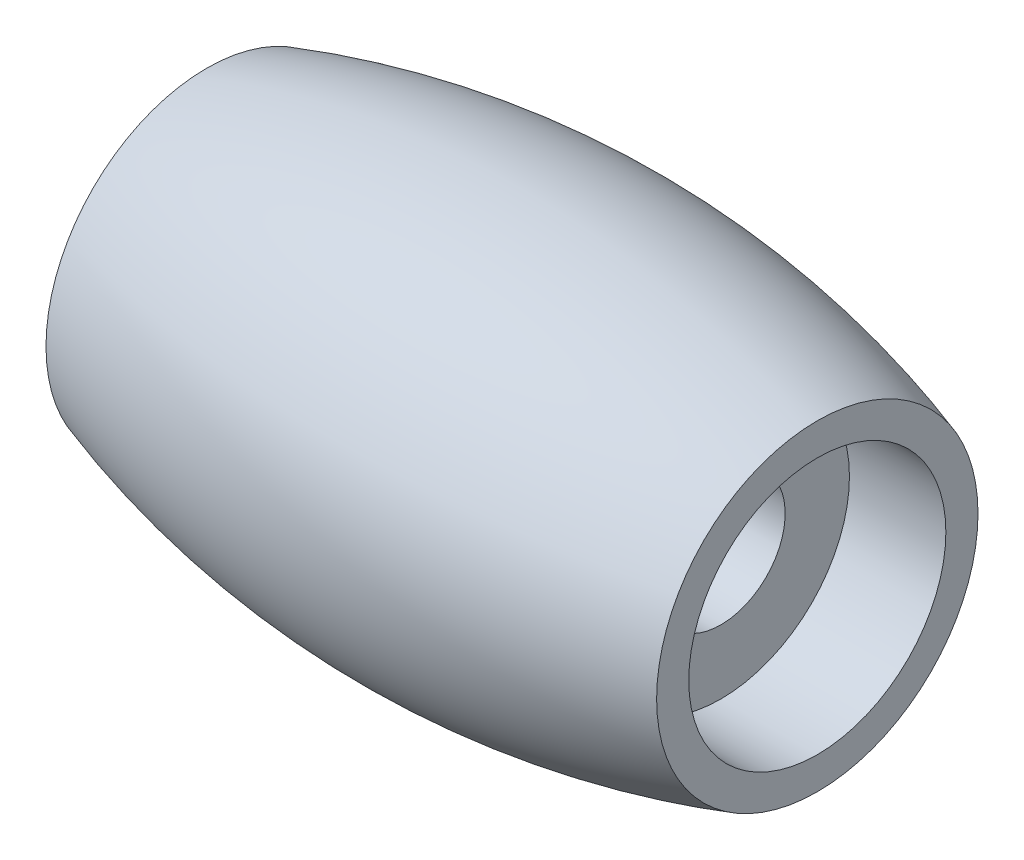
ISO-10303-21;
HEADER;
FILE_DESCRIPTION(('STEP AP214'),'2;1');
FILE_NAME('part.step','',(''),(''),'','','');
FILE_SCHEMA(('AUTOMOTIVE_DESIGN { 1 0 10303 214 1 1 1 1 }'));
ENDSEC;
DATA;
#1=APPLICATION_CONTEXT('core data for automotive mechanical design processes');
#2=APPLICATION_PROTOCOL_DEFINITION('international standard','automotive_design',2000,#1);
#3=PRODUCT_CONTEXT('',#1,'mechanical');
#4=PRODUCT('Part','Part','',(#3));
#5=PRODUCT_RELATED_PRODUCT_CATEGORY('part','',(#4));
#6=PRODUCT_DEFINITION_FORMATION('','',#4);
#7=PRODUCT_DEFINITION_CONTEXT('part definition',#1,'design');
#8=PRODUCT_DEFINITION('design','',#6,#7);
#9=PRODUCT_DEFINITION_SHAPE('','',#8);
#10=(LENGTH_UNIT() NAMED_UNIT(*) SI_UNIT(.MILLI.,.METRE.));
#11=(NAMED_UNIT(*) PLANE_ANGLE_UNIT() SI_UNIT($,.RADIAN.));
#12=(NAMED_UNIT(*) SI_UNIT($,.STERADIAN.) SOLID_ANGLE_UNIT());
#13=UNCERTAINTY_MEASURE_WITH_UNIT(LENGTH_MEASURE(1.E-05),#10,'distance_accuracy_value','');
#14=(GEOMETRIC_REPRESENTATION_CONTEXT(3) GLOBAL_UNCERTAINTY_ASSIGNED_CONTEXT((#13)) GLOBAL_UNIT_ASSIGNED_CONTEXT((#10,
#11,#12)) REPRESENTATION_CONTEXT('',''));
#15=CARTESIAN_POINT('',(0.,0.,0.));
#16=DIRECTION('',(0.,0.,1.));
#17=DIRECTION('',(1.,0.,0.));
#18=AXIS2_PLACEMENT_3D('',#15,#16,#17);
#19=CARTESIAN_POINT('',(0.,0.,0.));
#20=DIRECTION('',(-1.,0.,0.));
#21=DIRECTION('',(0.,0.,1.));
#22=AXIS2_PLACEMENT_3D('',#19,#20,#21);
#23=CYLINDRICAL_SURFACE('',#22,4.);
#24=CARTESIAN_POINT('',(3.,0.,0.));
#25=DIRECTION('',(-1.,0.,0.));
#26=DIRECTION('',(0.,0.,1.));
#27=AXIS2_PLACEMENT_3D('',#24,#25,#26);
#28=CIRCLE('',#27,4.);
#29=CARTESIAN_POINT('',(3.,0.,4.));
#30=VERTEX_POINT('',#29);
#31=EDGE_CURVE('E60',#30,#30,#28,.T.);
#32=ORIENTED_EDGE('',*,*,#31,.F.);
#33=EDGE_LOOP('',(#32));
#34=FACE_BOUND('',#33,.T.);
#35=CARTESIAN_POINT('',(0.,0.,0.));
#36=DIRECTION('',(-1.,0.,0.));
#37=DIRECTION('',(0.,0.,1.));
#38=AXIS2_PLACEMENT_3D('',#35,#36,#37);
#39=CIRCLE('',#38,4.);
#40=CARTESIAN_POINT('',(0.,0.,4.));
#41=VERTEX_POINT('',#40);
#42=EDGE_CURVE('E10',#41,#41,#39,.T.);
#43=ORIENTED_EDGE('',*,*,#42,.T.);
#44=EDGE_LOOP('',(#43));
#45=FACE_BOUND('',#44,.T.);
#46=ADVANCED_FACE('F32',(#34,#45),#23,.F.);
#47=CARTESIAN_POINT('',(0.,4.,0.));
#48=DIRECTION('',(1.,0.,0.));
#49=DIRECTION('',(0.,0.,-1.));
#50=AXIS2_PLACEMENT_3D('',#47,#48,#49);
#51=PLANE('',#50);
#52=ORIENTED_EDGE('',*,*,#42,.F.);
#53=EDGE_LOOP('',(#52));
#54=FACE_BOUND('',#53,.T.);
#55=CARTESIAN_POINT('',(0.,0.,0.));
#56=DIRECTION('',(-1.,0.,0.));
#57=DIRECTION('',(0.,0.,1.));
#58=AXIS2_PLACEMENT_3D('',#55,#56,#57);
#59=CIRCLE('',#58,5.);
#60=CARTESIAN_POINT('',(0.,0.,5.));
#61=VERTEX_POINT('',#60);
#62=EDGE_CURVE('E38',#61,#61,#59,.T.);
#63=ORIENTED_EDGE('',*,*,#62,.T.);
#64=EDGE_LOOP('',(#63));
#65=FACE_BOUND('',#64,.T.);
#66=ADVANCED_FACE('F67',(#54,#65),#51,.F.);
#67=CARTESIAN_POINT('',(9.5,0.,0.));
#68=DIRECTION('',(-1.,0.,0.));
#69=DIRECTION('',(0.,0.,1.));
#70=AXIS2_PLACEMENT_3D('',#67,#68,#69);
#71=DEGENERATE_TOROIDAL_SURFACE('',#70,24.3329829543468,30.833,.F.);
#72=ORIENTED_EDGE('',*,*,#62,.F.);
#73=EDGE_LOOP('',(#72));
#74=FACE_BOUND('',#73,.T.);
#75=CARTESIAN_POINT('',(19.,0.,0.));
#76=DIRECTION('',(-1.,0.,0.));
#77=DIRECTION('',(0.,0.,1.));
#78=AXIS2_PLACEMENT_3D('',#75,#76,#77);
#79=CIRCLE('',#78,5.);
#80=CARTESIAN_POINT('',(19.,0.,5.));
#81=VERTEX_POINT('',#80);
#82=EDGE_CURVE('E42',#81,#81,#79,.T.);
#83=ORIENTED_EDGE('',*,*,#82,.T.);
#84=EDGE_LOOP('',(#83));
#85=FACE_BOUND('',#84,.T.);
#86=ADVANCED_FACE('F71',(#74,#85),#71,.F.);
#87=CARTESIAN_POINT('',(19.,4.,0.));
#88=DIRECTION('',(-1.,0.,0.));
#89=DIRECTION('',(0.,0.,1.));
#90=AXIS2_PLACEMENT_3D('',#87,#88,#89);
#91=PLANE('',#90);
#92=ORIENTED_EDGE('',*,*,#82,.F.);
#93=EDGE_LOOP('',(#92));
#94=FACE_BOUND('',#93,.T.);
#95=CARTESIAN_POINT('',(19.,0.,0.));
#96=DIRECTION('',(-1.,0.,0.));
#97=DIRECTION('',(0.,0.,1.));
#98=AXIS2_PLACEMENT_3D('',#95,#96,#97);
#99=CIRCLE('',#98,4.);
#100=CARTESIAN_POINT('',(19.,0.,4.));
#101=VERTEX_POINT('',#100);
#102=EDGE_CURVE('E46',#101,#101,#99,.T.);
#103=ORIENTED_EDGE('',*,*,#102,.T.);
#104=EDGE_LOOP('',(#103));
#105=FACE_BOUND('',#104,.T.);
#106=ADVANCED_FACE('F76',(#94,#105),#91,.F.);
#107=CARTESIAN_POINT('',(0.,0.,0.));
#108=DIRECTION('',(-1.,0.,0.));
#109=DIRECTION('',(0.,0.,1.));
#110=AXIS2_PLACEMENT_3D('',#107,#108,#109);
#111=CYLINDRICAL_SURFACE('',#110,4.);
#112=ORIENTED_EDGE('',*,*,#102,.F.);
#113=EDGE_LOOP('',(#112));
#114=FACE_BOUND('',#113,.T.);
#115=CARTESIAN_POINT('',(16.,0.,0.));
#116=DIRECTION('',(-1.,0.,0.));
#117=DIRECTION('',(0.,0.,1.));
#118=AXIS2_PLACEMENT_3D('',#115,#116,#117);
#119=CIRCLE('',#118,4.);
#120=CARTESIAN_POINT('',(16.,0.,4.));
#121=VERTEX_POINT('',#120);
#122=EDGE_CURVE('E51',#121,#121,#119,.T.);
#123=ORIENTED_EDGE('',*,*,#122,.T.);
#124=EDGE_LOOP('',(#123));
#125=FACE_BOUND('',#124,.T.);
#126=ADVANCED_FACE('F82',(#114,#125),#111,.F.);
#127=CARTESIAN_POINT('',(16.,2.,0.));
#128=DIRECTION('',(-1.,0.,0.));
#129=DIRECTION('',(0.,0.,1.));
#130=AXIS2_PLACEMENT_3D('',#127,#128,#129);
#131=PLANE('',#130);
#132=ORIENTED_EDGE('',*,*,#122,.F.);
#133=EDGE_LOOP('',(#132));
#134=FACE_BOUND('',#133,.T.);
#135=CARTESIAN_POINT('',(16.,0.,0.));
#136=DIRECTION('',(-1.,0.,0.));
#137=DIRECTION('',(0.,0.,1.));
#138=AXIS2_PLACEMENT_3D('',#135,#136,#137);
#139=CIRCLE('',#138,2.);
#140=CARTESIAN_POINT('',(16.,0.,2.));
#141=VERTEX_POINT('',#140);
#142=EDGE_CURVE('E54',#141,#141,#139,.T.);
#143=ORIENTED_EDGE('',*,*,#142,.T.);
#144=EDGE_LOOP('',(#143));
#145=FACE_BOUND('',#144,.T.);
#146=ADVANCED_FACE('F86',(#134,#145),#131,.F.);
#147=CARTESIAN_POINT('',(0.,0.,0.));
#148=DIRECTION('',(-1.,0.,0.));
#149=DIRECTION('',(0.,0.,1.));
#150=AXIS2_PLACEMENT_3D('',#147,#148,#149);
#151=CYLINDRICAL_SURFACE('',#150,2.);
#152=ORIENTED_EDGE('',*,*,#142,.F.);
#153=EDGE_LOOP('',(#152));
#154=FACE_BOUND('',#153,.T.);
#155=CARTESIAN_POINT('',(3.,0.,0.));
#156=DIRECTION('',(-1.,0.,0.));
#157=DIRECTION('',(0.,0.,1.));
#158=AXIS2_PLACEMENT_3D('',#155,#156,#157);
#159=CIRCLE('',#158,2.);
#160=CARTESIAN_POINT('',(3.,0.,2.));
#161=VERTEX_POINT('',#160);
#162=EDGE_CURVE('E57',#161,#161,#159,.T.);
#163=ORIENTED_EDGE('',*,*,#162,.T.);
#164=EDGE_LOOP('',(#163));
#165=FACE_BOUND('',#164,.T.);
#166=ADVANCED_FACE('F90',(#154,#165),#151,.F.);
#167=CARTESIAN_POINT('',(3.,4.,0.));
#168=DIRECTION('',(1.,0.,0.));
#169=DIRECTION('',(0.,0.,-1.));
#170=AXIS2_PLACEMENT_3D('',#167,#168,#169);
#171=PLANE('',#170);
#172=ORIENTED_EDGE('',*,*,#162,.F.);
#173=EDGE_LOOP('',(#172));
#174=FACE_BOUND('',#173,.T.);
#175=ORIENTED_EDGE('',*,*,#31,.T.);
#176=EDGE_LOOP('',(#175));
#177=FACE_BOUND('',#176,.T.);
#178=ADVANCED_FACE('F64',(#174,#177),#171,.F.);
#179=CLOSED_SHELL('',(#46,#66,#86,#106,#126,#146,#166,#178));
#180=MANIFOLD_SOLID_BREP('B2',#179);
#181=ADVANCED_BREP_SHAPE_REPRESENTATION('',(#18,#180),#14);
#182=SHAPE_DEFINITION_REPRESENTATION(#9,#181);
ENDSEC;
END-ISO-10303-21;
